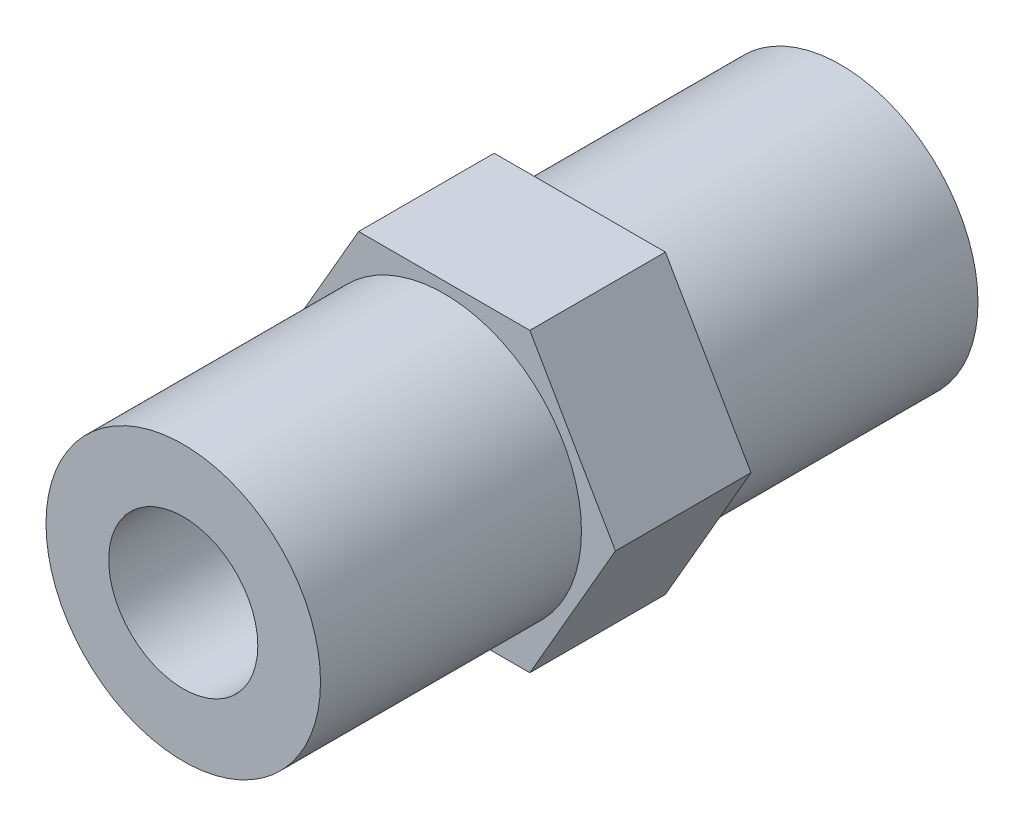
ISO-10303-21;
HEADER;
FILE_DESCRIPTION(('STEP AP214'),'2;1');
FILE_NAME('part.step','',(''),(''),'','','');
FILE_SCHEMA(('AUTOMOTIVE_DESIGN { 1 0 10303 214 1 1 1 1 }'));
ENDSEC;
DATA;
#1=APPLICATION_CONTEXT('core data for automotive mechanical design processes');
#2=APPLICATION_PROTOCOL_DEFINITION('international standard','automotive_design',2000,#1);
#3=PRODUCT_CONTEXT('',#1,'mechanical');
#4=PRODUCT('Part','Part','',(#3));
#5=PRODUCT_RELATED_PRODUCT_CATEGORY('part','',(#4));
#6=PRODUCT_DEFINITION_FORMATION('','',#4);
#7=PRODUCT_DEFINITION_CONTEXT('part definition',#1,'design');
#8=PRODUCT_DEFINITION('design','',#6,#7);
#9=PRODUCT_DEFINITION_SHAPE('','',#8);
#10=(LENGTH_UNIT() NAMED_UNIT(*) SI_UNIT(.MILLI.,.METRE.));
#11=(NAMED_UNIT(*) PLANE_ANGLE_UNIT() SI_UNIT($,.RADIAN.));
#12=(NAMED_UNIT(*) SI_UNIT($,.STERADIAN.) SOLID_ANGLE_UNIT());
#13=UNCERTAINTY_MEASURE_WITH_UNIT(LENGTH_MEASURE(1.E-05),#10,'distance_accuracy_value','');
#14=(GEOMETRIC_REPRESENTATION_CONTEXT(3) GLOBAL_UNCERTAINTY_ASSIGNED_CONTEXT((#13)) GLOBAL_UNIT_ASSIGNED_CONTEXT((#10,
#11,#12)) REPRESENTATION_CONTEXT('',''));
#15=CARTESIAN_POINT('',(0.,0.,0.));
#16=DIRECTION('',(0.,0.,1.));
#17=DIRECTION('',(1.,0.,0.));
#18=AXIS2_PLACEMENT_3D('',#15,#16,#17);
#19=CARTESIAN_POINT('',(0.,0.,12.319));
#20=DIRECTION('',(0.,0.,-1.));
#21=DIRECTION('',(-1.,0.,0.));
#22=AXIS2_PLACEMENT_3D('',#19,#20,#21);
#23=CYLINDRICAL_SURFACE('',#22,5.1435);
#24=CARTESIAN_POINT('',(0.,0.,2.54));
#25=DIRECTION('',(0.,0.,1.));
#26=DIRECTION('',(1.,0.,0.));
#27=AXIS2_PLACEMENT_3D('',#24,#25,#26);
#28=CIRCLE('',#27,5.1435);
#29=CARTESIAN_POINT('',(5.1435,0.,2.54));
#30=VERTEX_POINT('',#29);
#31=EDGE_CURVE('E138',#30,#30,#28,.T.);
#32=ORIENTED_EDGE('',*,*,#31,.T.);
#33=EDGE_LOOP('',(#32));
#34=FACE_BOUND('',#33,.T.);
#35=CARTESIAN_POINT('',(0.,0.,12.319));
#36=DIRECTION('',(0.,0.,1.));
#37=DIRECTION('',(1.,0.,0.));
#38=AXIS2_PLACEMENT_3D('',#35,#36,#37);
#39=CIRCLE('',#38,5.1435);
#40=CARTESIAN_POINT('',(5.1435,0.,12.319));
#41=VERTEX_POINT('',#40);
#42=EDGE_CURVE('E41',#41,#41,#39,.T.);
#43=ORIENTED_EDGE('',*,*,#42,.F.);
#44=EDGE_LOOP('',(#43));
#45=FACE_BOUND('',#44,.T.);
#46=ADVANCED_FACE('F32',(#34,#45),#23,.T.);
#47=CARTESIAN_POINT('',(0.,0.,12.319));
#48=DIRECTION('',(0.,0.,1.));
#49=DIRECTION('',(1.,0.,0.));
#50=AXIS2_PLACEMENT_3D('',#47,#48,#49);
#51=PLANE('',#50);
#52=CARTESIAN_POINT('',(0.,0.,12.319));
#53=DIRECTION('',(0.,0.,1.));
#54=DIRECTION('',(1.,0.,0.));
#55=AXIS2_PLACEMENT_3D('',#52,#53,#54);
#56=CIRCLE('',#55,2.794);
#57=CARTESIAN_POINT('',(2.794,0.,12.319));
#58=VERTEX_POINT('',#57);
#59=EDGE_CURVE('E142',#58,#58,#56,.T.);
#60=ORIENTED_EDGE('',*,*,#59,.F.);
#61=EDGE_LOOP('',(#60));
#62=FACE_BOUND('',#61,.T.);
#63=ORIENTED_EDGE('',*,*,#42,.T.);
#64=EDGE_LOOP('',(#63));
#65=FACE_BOUND('',#64,.T.);
#66=ADVANCED_FACE('F165',(#62,#65),#51,.T.);
#67=CARTESIAN_POINT('',(0.,0.,-12.319));
#68=DIRECTION('',(0.,0.,1.));
#69=DIRECTION('',(1.,0.,0.));
#70=AXIS2_PLACEMENT_3D('',#67,#68,#69);
#71=CYLINDRICAL_SURFACE('',#70,2.794);
#72=ORIENTED_EDGE('',*,*,#59,.T.);
#73=EDGE_LOOP('',(#72));
#74=FACE_BOUND('',#73,.T.);
#75=CARTESIAN_POINT('',(0.,0.,-12.319));
#76=DIRECTION('',(0.,0.,1.));
#77=DIRECTION('',(1.,0.,0.));
#78=AXIS2_PLACEMENT_3D('',#75,#76,#77);
#79=CIRCLE('',#78,2.794);
#80=CARTESIAN_POINT('',(2.794,0.,-12.319));
#81=VERTEX_POINT('',#80);
#82=EDGE_CURVE('E143',#81,#81,#79,.T.);
#83=ORIENTED_EDGE('',*,*,#82,.F.);
#84=EDGE_LOOP('',(#83));
#85=FACE_BOUND('',#84,.T.);
#86=ADVANCED_FACE('F170',(#74,#85),#71,.F.);
#87=CARTESIAN_POINT('',(0.,0.,2.54));
#88=DIRECTION('',(0.,0.,1.));
#89=DIRECTION('',(1.,0.,0.));
#90=AXIS2_PLACEMENT_3D('',#87,#88,#89);
#91=PLANE('',#90);
#92=DIRECTION('',(-0.5,0.866025403784438,0.));
#93=VECTOR('',#92,1.);
#94=CARTESIAN_POINT('',(6.41580486636972,0.,2.54));
#95=LINE('',#94,#93);
#96=CARTESIAN_POINT('',(6.41580486636972,0.,2.54));
#97=VERTEX_POINT('',#96);
#98=CARTESIAN_POINT('',(3.20790243318486,5.55625,2.54));
#99=VERTEX_POINT('',#98);
#100=EDGE_CURVE('E130',#97,#99,#95,.T.);
#101=ORIENTED_EDGE('',*,*,#100,.T.);
#102=DIRECTION('',(-1.,0.,0.));
#103=VECTOR('',#102,1.);
#104=CARTESIAN_POINT('',(3.20790243318486,5.55625,2.54));
#105=LINE('',#104,#103);
#106=CARTESIAN_POINT('',(-3.20790243318486,5.55625,2.54));
#107=VERTEX_POINT('',#106);
#108=EDGE_CURVE('E88',#99,#107,#105,.T.);
#109=ORIENTED_EDGE('',*,*,#108,.T.);
#110=DIRECTION('',(-0.5,-0.866025403784438,0.));
#111=VECTOR('',#110,1.);
#112=CARTESIAN_POINT('',(-3.20790243318486,5.55625,2.54));
#113=LINE('',#112,#111);
#114=CARTESIAN_POINT('',(-6.41580486636972,0.,2.54));
#115=VERTEX_POINT('',#114);
#116=EDGE_CURVE('E102',#107,#115,#113,.T.);
#117=ORIENTED_EDGE('',*,*,#116,.T.);
#118=DIRECTION('',(0.5,-0.866025403784439,0.));
#119=VECTOR('',#118,1.);
#120=CARTESIAN_POINT('',(-6.41580486636972,0.,2.54));
#121=LINE('',#120,#119);
#122=CARTESIAN_POINT('',(-3.20790243318486,-5.55625,2.54));
#123=VERTEX_POINT('',#122);
#124=EDGE_CURVE('E95',#115,#123,#121,.T.);
#125=ORIENTED_EDGE('',*,*,#124,.T.);
#126=DIRECTION('',(1.,0.,0.));
#127=VECTOR('',#126,1.);
#128=CARTESIAN_POINT('',(-3.20790243318486,-5.55625,2.54));
#129=LINE('',#128,#127);
#130=CARTESIAN_POINT('',(3.20790243318486,-5.55625,2.54));
#131=VERTEX_POINT('',#130);
#132=EDGE_CURVE('E100',#123,#131,#129,.T.);
#133=ORIENTED_EDGE('',*,*,#132,.T.);
#134=DIRECTION('',(0.5,0.866025403784439,0.));
#135=VECTOR('',#134,1.);
#136=CARTESIAN_POINT('',(3.20790243318486,-5.55625,2.54));
#137=LINE('',#136,#135);
#138=EDGE_CURVE('E50',#131,#97,#137,.T.);
#139=ORIENTED_EDGE('',*,*,#138,.T.);
#140=EDGE_LOOP('',(#101,#109,#117,#125,#133,#139));
#141=FACE_BOUND('',#140,.T.);
#142=ORIENTED_EDGE('',*,*,#31,.F.);
#143=EDGE_LOOP('',(#142));
#144=FACE_BOUND('',#143,.T.);
#145=ADVANCED_FACE('F97',(#141,#144),#91,.T.);
#146=CARTESIAN_POINT('',(0.,0.,-2.54));
#147=DIRECTION('',(0.,0.,1.));
#148=DIRECTION('',(1.,0.,0.));
#149=AXIS2_PLACEMENT_3D('',#146,#147,#148);
#150=PLANE('',#149);
#151=DIRECTION('',(-0.5,0.866025403784438,0.));
#152=VECTOR('',#151,1.);
#153=CARTESIAN_POINT('',(6.41580486636972,0.,-2.54));
#154=LINE('',#153,#152);
#155=CARTESIAN_POINT('',(6.41580486636972,0.,-2.54));
#156=VERTEX_POINT('',#155);
#157=CARTESIAN_POINT('',(3.20790243318486,5.55625,-2.54));
#158=VERTEX_POINT('',#157);
#159=EDGE_CURVE('E120',#156,#158,#154,.T.);
#160=ORIENTED_EDGE('',*,*,#159,.F.);
#161=DIRECTION('',(0.5,0.866025403784439,0.));
#162=VECTOR('',#161,1.);
#163=CARTESIAN_POINT('',(3.20790243318486,-5.55625,-2.54));
#164=LINE('',#163,#162);
#165=CARTESIAN_POINT('',(3.20790243318486,-5.55625,-2.54));
#166=VERTEX_POINT('',#165);
#167=EDGE_CURVE('E79',#166,#156,#164,.T.);
#168=ORIENTED_EDGE('',*,*,#167,.F.);
#169=DIRECTION('',(1.,0.,0.));
#170=VECTOR('',#169,1.);
#171=CARTESIAN_POINT('',(-3.20790243318486,-5.55625,-2.54));
#172=LINE('',#171,#170);
#173=CARTESIAN_POINT('',(-3.20790243318486,-5.55625,-2.54));
#174=VERTEX_POINT('',#173);
#175=EDGE_CURVE('E73',#174,#166,#172,.T.);
#176=ORIENTED_EDGE('',*,*,#175,.F.);
#177=DIRECTION('',(0.5,-0.866025403784439,0.));
#178=VECTOR('',#177,1.);
#179=CARTESIAN_POINT('',(-6.41580486636972,0.,-2.54));
#180=LINE('',#179,#178);
#181=CARTESIAN_POINT('',(-6.41580486636972,0.,-2.54));
#182=VERTEX_POINT('',#181);
#183=EDGE_CURVE('E110',#182,#174,#180,.T.);
#184=ORIENTED_EDGE('',*,*,#183,.F.);
#185=DIRECTION('',(-0.5,-0.866025403784438,0.));
#186=VECTOR('',#185,1.);
#187=CARTESIAN_POINT('',(-3.20790243318486,5.55625,-2.54));
#188=LINE('',#187,#186);
#189=CARTESIAN_POINT('',(-3.20790243318486,5.55625,-2.54));
#190=VERTEX_POINT('',#189);
#191=EDGE_CURVE('E125',#190,#182,#188,.T.);
#192=ORIENTED_EDGE('',*,*,#191,.F.);
#193=DIRECTION('',(-1.,0.,0.));
#194=VECTOR('',#193,1.);
#195=CARTESIAN_POINT('',(3.20790243318486,5.55625,-2.54));
#196=LINE('',#195,#194);
#197=EDGE_CURVE('E123',#158,#190,#196,.T.);
#198=ORIENTED_EDGE('',*,*,#197,.F.);
#199=EDGE_LOOP('',(#160,#168,#176,#184,#192,#198));
#200=FACE_BOUND('',#199,.T.);
#201=CARTESIAN_POINT('',(0.,0.,-2.54));
#202=DIRECTION('',(0.,0.,1.));
#203=DIRECTION('',(1.,0.,0.));
#204=AXIS2_PLACEMENT_3D('',#201,#202,#203);
#205=CIRCLE('',#204,5.1435);
#206=CARTESIAN_POINT('',(5.1435,0.,-2.54));
#207=VERTEX_POINT('',#206);
#208=EDGE_CURVE('E11',#207,#207,#205,.T.);
#209=ORIENTED_EDGE('',*,*,#208,.T.);
#210=EDGE_LOOP('',(#209));
#211=FACE_BOUND('',#210,.T.);
#212=ADVANCED_FACE('F175',(#200,#211),#150,.F.);
#213=CARTESIAN_POINT('',(6.41580486636972,0.,2.54));
#214=DIRECTION('',(-0.866025403784438,-0.5,0.));
#215=DIRECTION('',(0.5,-0.866025403784439,0.));
#216=AXIS2_PLACEMENT_3D('',#213,#214,#215);
#217=PLANE('',#216);
#218=ORIENTED_EDGE('',*,*,#159,.T.);
#219=DIRECTION('',(0.,0.,-1.));
#220=VECTOR('',#219,1.);
#221=CARTESIAN_POINT('',(3.20790243318486,5.55625,2.54));
#222=LINE('',#221,#220);
#223=EDGE_CURVE('E137',#99,#158,#222,.T.);
#224=ORIENTED_EDGE('',*,*,#223,.F.);
#225=ORIENTED_EDGE('',*,*,#100,.F.);
#226=DIRECTION('',(0.,0.,-1.));
#227=VECTOR('',#226,1.);
#228=CARTESIAN_POINT('',(6.41580486636972,0.,2.54));
#229=LINE('',#228,#227);
#230=EDGE_CURVE('E116',#97,#156,#229,.T.);
#231=ORIENTED_EDGE('',*,*,#230,.T.);
#232=EDGE_LOOP('',(#218,#224,#225,#231));
#233=FACE_BOUND('',#232,.T.);
#234=ADVANCED_FACE('F181',(#233),#217,.F.);
#235=CARTESIAN_POINT('',(3.20790243318486,5.55625,2.54));
#236=DIRECTION('',(0.,-1.,0.));
#237=DIRECTION('',(0.,0.,-1.));
#238=AXIS2_PLACEMENT_3D('',#235,#236,#237);
#239=PLANE('',#238);
#240=ORIENTED_EDGE('',*,*,#197,.T.);
#241=DIRECTION('',(0.,0.,-1.));
#242=VECTOR('',#241,1.);
#243=CARTESIAN_POINT('',(-3.20790243318486,5.55625,2.54));
#244=LINE('',#243,#242);
#245=EDGE_CURVE('E134',#107,#190,#244,.T.);
#246=ORIENTED_EDGE('',*,*,#245,.F.);
#247=ORIENTED_EDGE('',*,*,#108,.F.);
#248=ORIENTED_EDGE('',*,*,#223,.T.);
#249=EDGE_LOOP('',(#240,#246,#247,#248));
#250=FACE_BOUND('',#249,.T.);
#251=ADVANCED_FACE('F196',(#250),#239,.F.);
#252=CARTESIAN_POINT('',(-3.20790243318486,5.55625,2.54));
#253=DIRECTION('',(0.866025403784438,-0.5,0.));
#254=DIRECTION('',(0.5,0.866025403784439,0.));
#255=AXIS2_PLACEMENT_3D('',#252,#253,#254);
#256=PLANE('',#255);
#257=ORIENTED_EDGE('',*,*,#191,.T.);
#258=DIRECTION('',(0.,0.,-1.));
#259=VECTOR('',#258,1.);
#260=CARTESIAN_POINT('',(-6.41580486636972,0.,2.54));
#261=LINE('',#260,#259);
#262=EDGE_CURVE('E111',#115,#182,#261,.T.);
#263=ORIENTED_EDGE('',*,*,#262,.F.);
#264=ORIENTED_EDGE('',*,*,#116,.F.);
#265=ORIENTED_EDGE('',*,*,#245,.T.);
#266=EDGE_LOOP('',(#257,#263,#264,#265));
#267=FACE_BOUND('',#266,.T.);
#268=ADVANCED_FACE('F193',(#267),#256,.F.);
#269=CARTESIAN_POINT('',(-6.41580486636972,0.,2.54));
#270=DIRECTION('',(0.866025403784439,0.5,0.));
#271=DIRECTION('',(-0.5,0.866025403784439,0.));
#272=AXIS2_PLACEMENT_3D('',#269,#270,#271);
#273=PLANE('',#272);
#274=ORIENTED_EDGE('',*,*,#183,.T.);
#275=DIRECTION('',(0.,0.,-1.));
#276=VECTOR('',#275,1.);
#277=CARTESIAN_POINT('',(-3.20790243318486,-5.55625,2.54));
#278=LINE('',#277,#276);
#279=EDGE_CURVE('E107',#123,#174,#278,.T.);
#280=ORIENTED_EDGE('',*,*,#279,.F.);
#281=ORIENTED_EDGE('',*,*,#124,.F.);
#282=ORIENTED_EDGE('',*,*,#262,.T.);
#283=EDGE_LOOP('',(#274,#280,#281,#282));
#284=FACE_BOUND('',#283,.T.);
#285=ADVANCED_FACE('F108',(#284),#273,.F.);
#286=CARTESIAN_POINT('',(-3.20790243318486,-5.55625,2.54));
#287=DIRECTION('',(0.,1.,0.));
#288=DIRECTION('',(0.,0.,1.));
#289=AXIS2_PLACEMENT_3D('',#286,#287,#288);
#290=PLANE('',#289);
#291=ORIENTED_EDGE('',*,*,#175,.T.);
#292=DIRECTION('',(0.,0.,-1.));
#293=VECTOR('',#292,1.);
#294=CARTESIAN_POINT('',(3.20790243318486,-5.55625,2.54));
#295=LINE('',#294,#293);
#296=EDGE_CURVE('E112',#131,#166,#295,.T.);
#297=ORIENTED_EDGE('',*,*,#296,.F.);
#298=ORIENTED_EDGE('',*,*,#132,.F.);
#299=ORIENTED_EDGE('',*,*,#279,.T.);
#300=EDGE_LOOP('',(#291,#297,#298,#299));
#301=FACE_BOUND('',#300,.T.);
#302=ADVANCED_FACE('F114',(#301),#290,.F.);
#303=CARTESIAN_POINT('',(3.20790243318486,-5.55625,2.54));
#304=DIRECTION('',(-0.866025403784439,0.5,0.));
#305=DIRECTION('',(-0.5,-0.866025403784439,0.));
#306=AXIS2_PLACEMENT_3D('',#303,#304,#305);
#307=PLANE('',#306);
#308=ORIENTED_EDGE('',*,*,#167,.T.);
#309=ORIENTED_EDGE('',*,*,#230,.F.);
#310=ORIENTED_EDGE('',*,*,#138,.F.);
#311=ORIENTED_EDGE('',*,*,#296,.T.);
#312=EDGE_LOOP('',(#308,#309,#310,#311));
#313=FACE_BOUND('',#312,.T.);
#314=ADVANCED_FACE('F162',(#313),#307,.F.);
#315=CARTESIAN_POINT('',(0.,0.,-12.319));
#316=DIRECTION('',(0.,0.,1.));
#317=DIRECTION('',(1.,0.,0.));
#318=AXIS2_PLACEMENT_3D('',#315,#316,#317);
#319=CIRCLE('',#318,5.1435);
#320=CARTESIAN_POINT('',(5.1435,0.,-12.319));
#321=VERTEX_POINT('',#320);
#322=EDGE_CURVE('E35',#321,#321,#319,.T.);
#323=ORIENTED_EDGE('',*,*,#322,.T.);
#324=EDGE_LOOP('',(#323));
#325=FACE_BOUND('',#324,.T.);
#326=ORIENTED_EDGE('',*,*,#208,.F.);
#327=EDGE_LOOP('',(#326));
#328=FACE_BOUND('',#327,.T.);
#329=ADVANCED_FACE('F153',(#325,#328),#23,.T.);
#330=CARTESIAN_POINT('',(0.,0.,-12.319));
#331=DIRECTION('',(0.,0.,1.));
#332=DIRECTION('',(1.,0.,0.));
#333=AXIS2_PLACEMENT_3D('',#330,#331,#332);
#334=PLANE('',#333);
#335=ORIENTED_EDGE('',*,*,#82,.T.);
#336=EDGE_LOOP('',(#335));
#337=FACE_BOUND('',#336,.T.);
#338=ORIENTED_EDGE('',*,*,#322,.F.);
#339=EDGE_LOOP('',(#338));
#340=FACE_BOUND('',#339,.T.);
#341=ADVANCED_FACE('F156',(#337,#340),#334,.F.);
#342=CLOSED_SHELL('',(#46,#66,#86,#145,#212,#234,#251,#268,#285,#302,#314,#329,#341));
#343=MANIFOLD_SOLID_BREP('B2',#342);
#344=ADVANCED_BREP_SHAPE_REPRESENTATION('',(#18,#343),#14);
#345=SHAPE_DEFINITION_REPRESENTATION(#9,#344);
ENDSEC;
END-ISO-10303-21;
